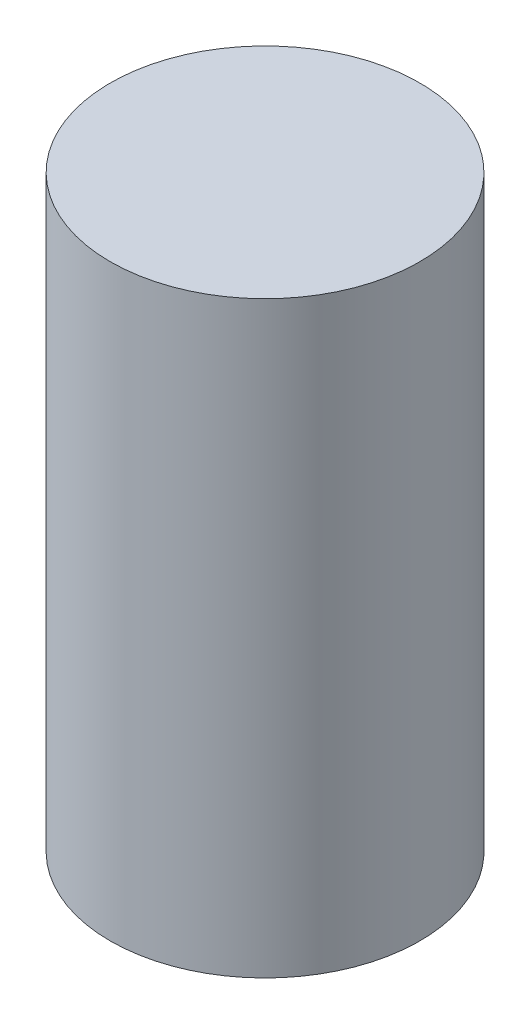
ISO-10303-21;
HEADER;
FILE_DESCRIPTION(('STEP AP214'),'2;1');
FILE_NAME('part.step','',(''),(''),'','','');
FILE_SCHEMA(('AUTOMOTIVE_DESIGN { 1 0 10303 214 1 1 1 1 }'));
ENDSEC;
DATA;
#1=APPLICATION_CONTEXT('core data for automotive mechanical design processes');
#2=APPLICATION_PROTOCOL_DEFINITION('international standard','automotive_design',2000,#1);
#3=PRODUCT_CONTEXT('',#1,'mechanical');
#4=PRODUCT('Part','Part','',(#3));
#5=PRODUCT_RELATED_PRODUCT_CATEGORY('part','',(#4));
#6=PRODUCT_DEFINITION_FORMATION('','',#4);
#7=PRODUCT_DEFINITION_CONTEXT('part definition',#1,'design');
#8=PRODUCT_DEFINITION('design','',#6,#7);
#9=PRODUCT_DEFINITION_SHAPE('','',#8);
#10=(LENGTH_UNIT() NAMED_UNIT(*) SI_UNIT(.MILLI.,.METRE.));
#11=(NAMED_UNIT(*) PLANE_ANGLE_UNIT() SI_UNIT($,.RADIAN.));
#12=(NAMED_UNIT(*) SI_UNIT($,.STERADIAN.) SOLID_ANGLE_UNIT());
#13=UNCERTAINTY_MEASURE_WITH_UNIT(LENGTH_MEASURE(1.E-05),#10,'distance_accuracy_value','');
#14=(GEOMETRIC_REPRESENTATION_CONTEXT(3) GLOBAL_UNCERTAINTY_ASSIGNED_CONTEXT((#13)) GLOBAL_UNIT_ASSIGNED_CONTEXT((#10,
#11,#12)) REPRESENTATION_CONTEXT('',''));
#15=CARTESIAN_POINT('',(0.,0.,0.));
#16=DIRECTION('',(0.,0.,1.));
#17=DIRECTION('',(1.,0.,0.));
#18=AXIS2_PLACEMENT_3D('',#15,#16,#17);
#19=CARTESIAN_POINT('',(0.,123.5,0.));
#20=DIRECTION('',(0.,-1.,0.));
#21=DIRECTION('',(0.,0.,-1.));
#22=AXIS2_PLACEMENT_3D('',#19,#20,#21);
#23=CYLINDRICAL_SURFACE('',#22,32.5);
#24=CARTESIAN_POINT('',(0.,123.5,0.));
#25=DIRECTION('',(0.,1.,0.));
#26=DIRECTION('',(0.,0.,1.));
#27=AXIS2_PLACEMENT_3D('',#24,#25,#26);
#28=CIRCLE('',#27,32.5);
#29=CARTESIAN_POINT('',(0.,123.5,32.5));
#30=VERTEX_POINT('',#29);
#31=EDGE_CURVE('E10',#30,#30,#28,.T.);
#32=ORIENTED_EDGE('',*,*,#31,.F.);
#33=EDGE_LOOP('',(#32));
#34=FACE_BOUND('',#33,.T.);
#35=CARTESIAN_POINT('',(0.,0.,0.));
#36=DIRECTION('',(0.,1.,0.));
#37=DIRECTION('',(0.,0.,1.));
#38=AXIS2_PLACEMENT_3D('',#35,#36,#37);
#39=CIRCLE('',#38,32.5);
#40=CARTESIAN_POINT('',(0.,0.,32.5));
#41=VERTEX_POINT('',#40);
#42=EDGE_CURVE('E38',#41,#41,#39,.T.);
#43=ORIENTED_EDGE('',*,*,#42,.T.);
#44=EDGE_LOOP('',(#43));
#45=FACE_BOUND('',#44,.T.);
#46=ADVANCED_FACE('F35',(#34,#45),#23,.T.);
#47=CARTESIAN_POINT('',(0.,123.5,0.));
#48=DIRECTION('',(0.,1.,0.));
#49=DIRECTION('',(0.,0.,1.));
#50=AXIS2_PLACEMENT_3D('',#47,#48,#49);
#51=PLANE('',#50);
#52=ORIENTED_EDGE('',*,*,#31,.T.);
#53=EDGE_LOOP('',(#52));
#54=FACE_BOUND('',#53,.T.);
#55=ADVANCED_FACE('F50',(#54),#51,.T.);
#56=CARTESIAN_POINT('',(0.,0.,0.));
#57=DIRECTION('',(0.,1.,0.));
#58=DIRECTION('',(0.,0.,1.));
#59=AXIS2_PLACEMENT_3D('',#56,#57,#58);
#60=PLANE('',#59);
#61=ORIENTED_EDGE('',*,*,#42,.F.);
#62=EDGE_LOOP('',(#61));
#63=FACE_BOUND('',#62,.T.);
#64=ADVANCED_FACE('F48',(#63),#60,.F.);
#65=CLOSED_SHELL('',(#46,#55,#64));
#66=MANIFOLD_SOLID_BREP('B2',#65);
#67=ADVANCED_BREP_SHAPE_REPRESENTATION('',(#18,#66),#14);
#68=SHAPE_DEFINITION_REPRESENTATION(#9,#67);
ENDSEC;
END-ISO-10303-21;
